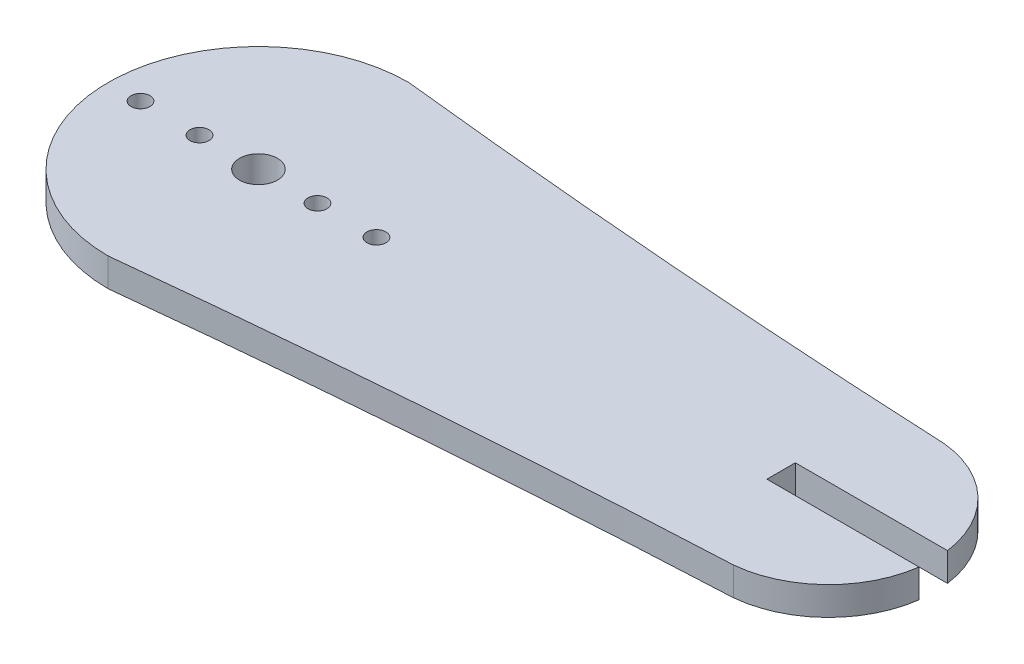
ISO-10303-21;
HEADER;
FILE_DESCRIPTION(('STEP AP214'),'2;1');
FILE_NAME('part.step','',(''),(''),'','','');
FILE_SCHEMA(('AUTOMOTIVE_DESIGN { 1 0 10303 214 1 1 1 1 }'));
ENDSEC;
DATA;
#1=APPLICATION_CONTEXT('core data for automotive mechanical design processes');
#2=APPLICATION_PROTOCOL_DEFINITION('international standard','automotive_design',2000,#1);
#3=PRODUCT_CONTEXT('',#1,'mechanical');
#4=PRODUCT('Part','Part','',(#3));
#5=PRODUCT_RELATED_PRODUCT_CATEGORY('part','',(#4));
#6=PRODUCT_DEFINITION_FORMATION('','',#4);
#7=PRODUCT_DEFINITION_CONTEXT('part definition',#1,'design');
#8=PRODUCT_DEFINITION('design','',#6,#7);
#9=PRODUCT_DEFINITION_SHAPE('','',#8);
#10=(LENGTH_UNIT() NAMED_UNIT(*) SI_UNIT(.MILLI.,.METRE.));
#11=(NAMED_UNIT(*) PLANE_ANGLE_UNIT() SI_UNIT($,.RADIAN.));
#12=(NAMED_UNIT(*) SI_UNIT($,.STERADIAN.) SOLID_ANGLE_UNIT());
#13=UNCERTAINTY_MEASURE_WITH_UNIT(LENGTH_MEASURE(1.E-05),#10,'distance_accuracy_value','');
#14=(GEOMETRIC_REPRESENTATION_CONTEXT(3) GLOBAL_UNCERTAINTY_ASSIGNED_CONTEXT((#13)) GLOBAL_UNIT_ASSIGNED_CONTEXT((#10,
#11,#12)) REPRESENTATION_CONTEXT('',''));
#15=CARTESIAN_POINT('',(0.,0.,0.));
#16=DIRECTION('',(0.,0.,1.));
#17=DIRECTION('',(1.,0.,0.));
#18=AXIS2_PLACEMENT_3D('',#15,#16,#17);
#19=CARTESIAN_POINT('',(0.,3.,13.3404443485137));
#20=DIRECTION('',(0.,0.,-1.));
#21=DIRECTION('',(-1.,0.,0.));
#22=AXIS2_PLACEMENT_3D('',#19,#20,#21);
#23=PLANE('',#22);
#24=DIRECTION('',(1.,0.,0.));
#25=VECTOR('',#24,1.);
#26=CARTESIAN_POINT('',(0.,0.,13.3404443485137));
#27=LINE('',#26,#25);
#28=CARTESIAN_POINT('',(48.1330676185325,0.,13.3404443485137));
#29=VERTEX_POINT('',#28);
#30=CARTESIAN_POINT('',(64.1909738664337,0.,13.3404443485137));
#31=VERTEX_POINT('',#30);
#32=EDGE_CURVE('E144',#29,#31,#27,.T.);
#33=ORIENTED_EDGE('',*,*,#32,.T.);
#34=DIRECTION('',(0.,-1.,0.));
#35=VECTOR('',#34,1.);
#36=CARTESIAN_POINT('',(64.1909738664337,3.,13.3404443485137));
#37=LINE('',#36,#35);
#38=CARTESIAN_POINT('',(64.1909738664337,3.,13.3404443485137));
#39=VERTEX_POINT('',#38);
#40=EDGE_CURVE('E11',#39,#31,#37,.T.);
#41=ORIENTED_EDGE('',*,*,#40,.F.);
#42=DIRECTION('',(1.,0.,0.));
#43=VECTOR('',#42,1.);
#44=CARTESIAN_POINT('',(0.,3.,13.3404443485137));
#45=LINE('',#44,#43);
#46=CARTESIAN_POINT('',(48.1330676185325,3.,13.3404443485137));
#47=VERTEX_POINT('',#46);
#48=EDGE_CURVE('E190',#47,#39,#45,.T.);
#49=ORIENTED_EDGE('',*,*,#48,.F.);
#50=DIRECTION('',(0.,-1.,0.));
#51=VECTOR('',#50,1.);
#52=CARTESIAN_POINT('',(48.1330676185325,3.,13.3404443485137));
#53=LINE('',#52,#51);
#54=EDGE_CURVE('E125',#47,#29,#53,.T.);
#55=ORIENTED_EDGE('',*,*,#54,.T.);
#56=EDGE_LOOP('',(#33,#41,#49,#55));
#57=FACE_BOUND('',#56,.T.);
#58=ADVANCED_FACE('F34',(#57),#23,.F.);
#59=CARTESIAN_POINT('',(53.1355271243014,3.,14.8404443484009));
#60=DIRECTION('',(0.,-1.,0.));
#61=DIRECTION('',(0.,0.,-1.));
#62=AXIS2_PLACEMENT_3D('',#59,#60,#61);
#63=CYLINDRICAL_SURFACE('',#62,11.1567424756438);
#64=CARTESIAN_POINT('',(53.1355271243014,0.,14.8404443484009));
#65=DIRECTION('',(0.,1.,0.));
#66=DIRECTION('',(0.,0.,1.));
#67=AXIS2_PLACEMENT_3D('',#64,#65,#66);
#68=CIRCLE('',#67,11.1567424756438);
#69=CARTESIAN_POINT('',(54.1898263577923,0.,3.73362861237414));
#70=VERTEX_POINT('',#69);
#71=EDGE_CURVE('E147',#31,#70,#68,.T.);
#72=ORIENTED_EDGE('',*,*,#71,.T.);
#73=DIRECTION('',(0.,-1.,0.));
#74=VECTOR('',#73,1.);
#75=CARTESIAN_POINT('',(54.1898263577923,3.,3.73362861237414));
#76=LINE('',#75,#74);
#77=CARTESIAN_POINT('',(54.1898263577923,3.,3.73362861237414));
#78=VERTEX_POINT('',#77);
#79=EDGE_CURVE('E43',#78,#70,#76,.T.);
#80=ORIENTED_EDGE('',*,*,#79,.F.);
#81=CARTESIAN_POINT('',(53.1355271243014,3.,14.8404443484009));
#82=DIRECTION('',(0.,1.,0.));
#83=DIRECTION('',(0.,0.,1.));
#84=AXIS2_PLACEMENT_3D('',#81,#82,#83);
#85=CIRCLE('',#84,11.1567424756438);
#86=EDGE_CURVE('E90',#39,#78,#85,.T.);
#87=ORIENTED_EDGE('',*,*,#86,.F.);
#88=ORIENTED_EDGE('',*,*,#40,.T.);
#89=EDGE_LOOP('',(#72,#80,#87,#88));
#90=FACE_BOUND('',#89,.T.);
#91=ADVANCED_FACE('F176',(#90),#63,.T.);
#92=CARTESIAN_POINT('',(100.965040160951,3.,-995.171812044386));
#93=DIRECTION('',(0.,-1.,0.));
#94=DIRECTION('',(0.,0.,-1.));
#95=AXIS2_PLACEMENT_3D('',#92,#93,#94);
#96=CYLINDRICAL_SURFACE('',#95,1000.);
#97=CARTESIAN_POINT('',(100.965040160951,0.,-995.171812044386));
#98=DIRECTION('',(0.,1.,0.));
#99=DIRECTION('',(0.,0.,1.));
#100=AXIS2_PLACEMENT_3D('',#97,#98,#99);
#101=CIRCLE('',#100,1000.);
#102=CARTESIAN_POINT('',(-7.02241794948157,0.,-1.01955565160642));
#103=VERTEX_POINT('',#102);
#104=EDGE_CURVE('E150',#103,#70,#101,.T.);
#105=ORIENTED_EDGE('',*,*,#104,.F.);
#106=DIRECTION('',(0.,-1.,0.));
#107=VECTOR('',#106,1.);
#108=CARTESIAN_POINT('',(-7.02241794948157,3.,-1.01955565160642));
#109=LINE('',#108,#107);
#110=CARTESIAN_POINT('',(-7.02241794948157,3.,-1.01955565160642));
#111=VERTEX_POINT('',#110);
#112=EDGE_CURVE('E169',#111,#103,#109,.T.);
#113=ORIENTED_EDGE('',*,*,#112,.F.);
#114=CARTESIAN_POINT('',(100.965040160951,3.,-995.171812044386));
#115=DIRECTION('',(0.,1.,0.));
#116=DIRECTION('',(0.,0.,1.));
#117=AXIS2_PLACEMENT_3D('',#114,#115,#116);
#118=CIRCLE('',#117,1000.);
#119=EDGE_CURVE('E175',#111,#78,#118,.T.);
#120=ORIENTED_EDGE('',*,*,#119,.T.);
#121=ORIENTED_EDGE('',*,*,#79,.T.);
#122=EDGE_LOOP('',(#105,#113,#120,#121));
#123=FACE_BOUND('',#122,.T.);
#124=ADVANCED_FACE('F173',(#123),#96,.F.);
#125=CARTESIAN_POINT('',(-7.02241794944201,3.,14.8404443484009));
#126=DIRECTION('',(0.,-1.,0.));
#127=DIRECTION('',(0.,0.,-1.));
#128=AXIS2_PLACEMENT_3D('',#125,#126,#127);
#129=CYLINDRICAL_SURFACE('',#128,15.8600000000073);
#130=CARTESIAN_POINT('',(-7.02241794944201,0.,14.8404443484009));
#131=DIRECTION('',(0.,1.,0.));
#132=DIRECTION('',(0.,0.,1.));
#133=AXIS2_PLACEMENT_3D('',#130,#131,#132);
#134=CIRCLE('',#133,15.8600000000073);
#135=CARTESIAN_POINT('',(-7.02241794947939,0.,30.7004443484083));
#136=VERTEX_POINT('',#135);
#137=EDGE_CURVE('E153',#103,#136,#134,.T.);
#138=ORIENTED_EDGE('',*,*,#137,.T.);
#139=DIRECTION('',(0.,-1.,0.));
#140=VECTOR('',#139,1.);
#141=CARTESIAN_POINT('',(-7.02241794947939,3.,30.7004443484083));
#142=LINE('',#141,#140);
#143=CARTESIAN_POINT('',(-7.02241794947939,3.,30.7004443484083));
#144=VERTEX_POINT('',#143);
#145=EDGE_CURVE('E167',#144,#136,#142,.T.);
#146=ORIENTED_EDGE('',*,*,#145,.F.);
#147=CARTESIAN_POINT('',(-7.02241794944201,3.,14.8404443484009));
#148=DIRECTION('',(0.,1.,0.));
#149=DIRECTION('',(0.,0.,1.));
#150=AXIS2_PLACEMENT_3D('',#147,#148,#149);
#151=CIRCLE('',#150,15.8600000000073);
#152=EDGE_CURVE('E187',#111,#144,#151,.T.);
#153=ORIENTED_EDGE('',*,*,#152,.F.);
#154=ORIENTED_EDGE('',*,*,#112,.T.);
#155=EDGE_LOOP('',(#138,#146,#153,#154));
#156=FACE_BOUND('',#155,.T.);
#157=ADVANCED_FACE('F185',(#156),#129,.T.);
#158=CARTESIAN_POINT('',(100.965040160942,3.,1024.85270074104));
#159=DIRECTION('',(0.,-1.,0.));
#160=DIRECTION('',(0.,0.,-1.));
#161=AXIS2_PLACEMENT_3D('',#158,#159,#160);
#162=CYLINDRICAL_SURFACE('',#161,999.99999999986);
#163=CARTESIAN_POINT('',(100.965040160942,0.,1024.85270074104));
#164=DIRECTION('',(0.,1.,0.));
#165=DIRECTION('',(0.,0.,1.));
#166=AXIS2_PLACEMENT_3D('',#163,#164,#165);
#167=CIRCLE('',#166,999.99999999986);
#168=CARTESIAN_POINT('',(54.1898263578284,0.,25.9472600844262));
#169=VERTEX_POINT('',#168);
#170=EDGE_CURVE('E156',#169,#136,#167,.T.);
#171=ORIENTED_EDGE('',*,*,#170,.F.);
#172=DIRECTION('',(0.,-1.,0.));
#173=VECTOR('',#172,1.);
#174=CARTESIAN_POINT('',(54.1898263578284,3.,25.9472600844262));
#175=LINE('',#174,#173);
#176=CARTESIAN_POINT('',(54.1898263578284,3.,25.9472600844262));
#177=VERTEX_POINT('',#176);
#178=EDGE_CURVE('E121',#177,#169,#175,.T.);
#179=ORIENTED_EDGE('',*,*,#178,.F.);
#180=CARTESIAN_POINT('',(100.965040160942,3.,1024.85270074104));
#181=DIRECTION('',(0.,1.,0.));
#182=DIRECTION('',(0.,0.,1.));
#183=AXIS2_PLACEMENT_3D('',#180,#181,#182);
#184=CIRCLE('',#183,999.99999999986);
#185=EDGE_CURVE('E110',#177,#144,#184,.T.);
#186=ORIENTED_EDGE('',*,*,#185,.T.);
#187=ORIENTED_EDGE('',*,*,#145,.T.);
#188=EDGE_LOOP('',(#171,#179,#186,#187));
#189=FACE_BOUND('',#188,.T.);
#190=ADVANCED_FACE('F194',(#189),#162,.F.);
#191=CARTESIAN_POINT('',(53.1355271243014,3.,14.8404443484009));
#192=DIRECTION('',(0.,-1.,0.));
#193=DIRECTION('',(0.,0.,-1.));
#194=AXIS2_PLACEMENT_3D('',#191,#192,#193);
#195=CYLINDRICAL_SURFACE('',#194,11.1567424756438);
#196=CARTESIAN_POINT('',(53.1355271243014,0.,14.8404443484009));
#197=DIRECTION('',(0.,1.,0.));
#198=DIRECTION('',(0.,0.,1.));
#199=AXIS2_PLACEMENT_3D('',#196,#197,#198);
#200=CIRCLE('',#199,11.1567424756438);
#201=CARTESIAN_POINT('',(64.1909738664337,0.,16.3404443482881));
#202=VERTEX_POINT('',#201);
#203=EDGE_CURVE('E117',#169,#202,#200,.T.);
#204=ORIENTED_EDGE('',*,*,#203,.T.);
#205=DIRECTION('',(0.,-1.,0.));
#206=VECTOR('',#205,1.);
#207=CARTESIAN_POINT('',(64.1909738664337,3.,16.3404443482881));
#208=LINE('',#207,#206);
#209=CARTESIAN_POINT('',(64.1909738664337,3.,16.3404443482881));
#210=VERTEX_POINT('',#209);
#211=EDGE_CURVE('E114',#210,#202,#208,.T.);
#212=ORIENTED_EDGE('',*,*,#211,.F.);
#213=CARTESIAN_POINT('',(53.1355271243014,3.,14.8404443484009));
#214=DIRECTION('',(0.,1.,0.));
#215=DIRECTION('',(0.,0.,1.));
#216=AXIS2_PLACEMENT_3D('',#213,#214,#215);
#217=CIRCLE('',#216,11.1567424756438);
#218=EDGE_CURVE('E104',#177,#210,#217,.T.);
#219=ORIENTED_EDGE('',*,*,#218,.F.);
#220=ORIENTED_EDGE('',*,*,#178,.T.);
#221=EDGE_LOOP('',(#204,#212,#219,#220));
#222=FACE_BOUND('',#221,.T.);
#223=ADVANCED_FACE('F115',(#222),#195,.T.);
#224=CARTESIAN_POINT('',(0.,3.,16.3404443482881));
#225=DIRECTION('',(0.,0.,-1.));
#226=DIRECTION('',(-1.,0.,0.));
#227=AXIS2_PLACEMENT_3D('',#224,#225,#226);
#228=PLANE('',#227);
#229=DIRECTION('',(1.,0.,0.));
#230=VECTOR('',#229,1.);
#231=CARTESIAN_POINT('',(0.,0.,16.3404443482881));
#232=LINE('',#231,#230);
#233=CARTESIAN_POINT('',(48.1330676185325,0.,16.3404443482881));
#234=VERTEX_POINT('',#233);
#235=EDGE_CURVE('E160',#234,#202,#232,.T.);
#236=ORIENTED_EDGE('',*,*,#235,.F.);
#237=DIRECTION('',(0.,-1.,0.));
#238=VECTOR('',#237,1.);
#239=CARTESIAN_POINT('',(48.1330676185325,3.,16.3404443482881));
#240=LINE('',#239,#238);
#241=CARTESIAN_POINT('',(48.1330676185325,3.,16.3404443482881));
#242=VERTEX_POINT('',#241);
#243=EDGE_CURVE('E79',#242,#234,#240,.T.);
#244=ORIENTED_EDGE('',*,*,#243,.F.);
#245=DIRECTION('',(1.,0.,0.));
#246=VECTOR('',#245,1.);
#247=CARTESIAN_POINT('',(0.,3.,16.3404443482881));
#248=LINE('',#247,#246);
#249=EDGE_CURVE('E108',#242,#210,#248,.T.);
#250=ORIENTED_EDGE('',*,*,#249,.T.);
#251=ORIENTED_EDGE('',*,*,#211,.T.);
#252=EDGE_LOOP('',(#236,#244,#250,#251));
#253=FACE_BOUND('',#252,.T.);
#254=ADVANCED_FACE('F123',(#253),#228,.T.);
#255=CARTESIAN_POINT('',(-19.472417949442,3.,14.8404443484009));
#256=DIRECTION('',(0.,-1.,0.));
#257=DIRECTION('',(0.,0.,-1.));
#258=AXIS2_PLACEMENT_3D('',#255,#256,#257);
#259=CYLINDRICAL_SURFACE('',#258,1.00000000004549);
#260=CARTESIAN_POINT('',(-19.472417949442,3.,14.8404443484009));
#261=DIRECTION('',(0.,1.,0.));
#262=DIRECTION('',(0.,0.,1.));
#263=AXIS2_PLACEMENT_3D('',#260,#261,#262);
#264=CIRCLE('',#263,1.00000000004549);
#265=CARTESIAN_POINT('',(-19.472417949442,3.,15.8404443484464));
#266=VERTEX_POINT('',#265);
#267=EDGE_CURVE('E355',#266,#266,#264,.F.);
#268=ORIENTED_EDGE('',*,*,#267,.F.);
#269=EDGE_LOOP('',(#268));
#270=FACE_BOUND('',#269,.T.);
#271=CARTESIAN_POINT('',(-19.472417949442,0.,14.8404443484009));
#272=DIRECTION('',(0.,1.,0.));
#273=DIRECTION('',(0.,0.,1.));
#274=AXIS2_PLACEMENT_3D('',#271,#272,#273);
#275=CIRCLE('',#274,1.00000000004549);
#276=CARTESIAN_POINT('',(-19.472417949442,0.,15.8404443484464));
#277=VERTEX_POINT('',#276);
#278=EDGE_CURVE('E141',#277,#277,#275,.F.);
#279=ORIENTED_EDGE('',*,*,#278,.T.);
#280=EDGE_LOOP('',(#279));
#281=FACE_BOUND('',#280,.T.);
#282=ADVANCED_FACE('F218',(#270,#281),#259,.F.);
#283=CARTESIAN_POINT('',(5.42758205055799,3.,14.8404443484009));
#284=DIRECTION('',(0.,-1.,0.));
#285=DIRECTION('',(0.,0.,-1.));
#286=AXIS2_PLACEMENT_3D('',#283,#284,#285);
#287=CYLINDRICAL_SURFACE('',#286,1.00000000004549);
#288=CARTESIAN_POINT('',(5.42758205055799,3.,14.8404443484009));
#289=DIRECTION('',(0.,1.,0.));
#290=DIRECTION('',(0.,0.,1.));
#291=AXIS2_PLACEMENT_3D('',#288,#289,#290);
#292=CIRCLE('',#291,1.00000000004549);
#293=CARTESIAN_POINT('',(5.42758205055799,3.,15.8404443484464));
#294=VERTEX_POINT('',#293);
#295=EDGE_CURVE('E348',#294,#294,#292,.T.);
#296=ORIENTED_EDGE('',*,*,#295,.T.);
#297=EDGE_LOOP('',(#296));
#298=FACE_BOUND('',#297,.T.);
#299=CARTESIAN_POINT('',(5.42758205055799,0.,14.8404443484009));
#300=DIRECTION('',(0.,1.,0.));
#301=DIRECTION('',(0.,0.,1.));
#302=AXIS2_PLACEMENT_3D('',#299,#300,#301);
#303=CIRCLE('',#302,1.00000000004549);
#304=CARTESIAN_POINT('',(5.42758205055799,0.,15.8404443484464));
#305=VERTEX_POINT('',#304);
#306=EDGE_CURVE('E138',#305,#305,#303,.T.);
#307=ORIENTED_EDGE('',*,*,#306,.F.);
#308=EDGE_LOOP('',(#307));
#309=FACE_BOUND('',#308,.T.);
#310=ADVANCED_FACE('F221',(#298,#309),#287,.F.);
#311=CARTESIAN_POINT('',(-0.797417949442007,3.,14.8404443484009));
#312=DIRECTION('',(0.,-1.,0.));
#313=DIRECTION('',(0.,0.,-1.));
#314=AXIS2_PLACEMENT_3D('',#311,#312,#313);
#315=CYLINDRICAL_SURFACE('',#314,1.00000000004549);
#316=CARTESIAN_POINT('',(-0.797417949442007,3.,14.8404443484009));
#317=DIRECTION('',(0.,1.,0.));
#318=DIRECTION('',(0.,0.,1.));
#319=AXIS2_PLACEMENT_3D('',#316,#317,#318);
#320=CIRCLE('',#319,1.00000000004549);
#321=CARTESIAN_POINT('',(-0.797417949442007,3.,15.8404443484464));
#322=VERTEX_POINT('',#321);
#323=EDGE_CURVE('E345',#322,#322,#320,.T.);
#324=ORIENTED_EDGE('',*,*,#323,.T.);
#325=EDGE_LOOP('',(#324));
#326=FACE_BOUND('',#325,.T.);
#327=CARTESIAN_POINT('',(-0.797417949442007,0.,14.8404443484009));
#328=DIRECTION('',(0.,1.,0.));
#329=DIRECTION('',(0.,0.,1.));
#330=AXIS2_PLACEMENT_3D('',#327,#328,#329);
#331=CIRCLE('',#330,1.00000000004549);
#332=CARTESIAN_POINT('',(-0.797417949442007,0.,15.8404443484464));
#333=VERTEX_POINT('',#332);
#334=EDGE_CURVE('E135',#333,#333,#331,.T.);
#335=ORIENTED_EDGE('',*,*,#334,.F.);
#336=EDGE_LOOP('',(#335));
#337=FACE_BOUND('',#336,.T.);
#338=ADVANCED_FACE('F225',(#326,#337),#315,.F.);
#339=CARTESIAN_POINT('',(-7.02241794944201,3.,14.8404443484009));
#340=DIRECTION('',(0.,-1.,0.));
#341=DIRECTION('',(0.,0.,-1.));
#342=AXIS2_PLACEMENT_3D('',#339,#340,#341);
#343=CYLINDRICAL_SURFACE('',#342,2.00000000004549);
#344=CARTESIAN_POINT('',(-7.02241794944201,3.,14.8404443484009));
#345=DIRECTION('',(0.,1.,0.));
#346=DIRECTION('',(0.,0.,1.));
#347=AXIS2_PLACEMENT_3D('',#344,#345,#346);
#348=CIRCLE('',#347,2.00000000004549);
#349=CARTESIAN_POINT('',(-7.02241794944201,3.,16.8404443484464));
#350=VERTEX_POINT('',#349);
#351=EDGE_CURVE('E236',#350,#350,#348,.T.);
#352=ORIENTED_EDGE('',*,*,#351,.T.);
#353=EDGE_LOOP('',(#352));
#354=FACE_BOUND('',#353,.T.);
#355=CARTESIAN_POINT('',(-7.02241794944201,0.,14.8404443484009));
#356=DIRECTION('',(0.,1.,0.));
#357=DIRECTION('',(0.,0.,1.));
#358=AXIS2_PLACEMENT_3D('',#355,#356,#357);
#359=CIRCLE('',#358,2.00000000004549);
#360=CARTESIAN_POINT('',(-7.02241794944201,0.,16.8404443484464));
#361=VERTEX_POINT('',#360);
#362=EDGE_CURVE('E132',#361,#361,#359,.T.);
#363=ORIENTED_EDGE('',*,*,#362,.F.);
#364=EDGE_LOOP('',(#363));
#365=FACE_BOUND('',#364,.T.);
#366=ADVANCED_FACE('F206',(#354,#365),#343,.F.);
#367=CARTESIAN_POINT('',(-13.247417949442,3.,14.8404443484009));
#368=DIRECTION('',(0.,-1.,0.));
#369=DIRECTION('',(0.,0.,-1.));
#370=AXIS2_PLACEMENT_3D('',#367,#368,#369);
#371=CYLINDRICAL_SURFACE('',#370,1.00000000004549);
#372=CARTESIAN_POINT('',(-13.247417949442,3.,14.8404443484009));
#373=DIRECTION('',(0.,1.,0.));
#374=DIRECTION('',(0.,0.,1.));
#375=AXIS2_PLACEMENT_3D('',#372,#373,#374);
#376=CIRCLE('',#375,1.00000000004549);
#377=CARTESIAN_POINT('',(-13.247417949442,3.,15.8404443484464));
#378=VERTEX_POINT('',#377);
#379=EDGE_CURVE('E163',#378,#378,#376,.F.);
#380=ORIENTED_EDGE('',*,*,#379,.F.);
#381=EDGE_LOOP('',(#380));
#382=FACE_BOUND('',#381,.T.);
#383=CARTESIAN_POINT('',(-13.247417949442,0.,14.8404443484009));
#384=DIRECTION('',(0.,1.,0.));
#385=DIRECTION('',(0.,0.,1.));
#386=AXIS2_PLACEMENT_3D('',#383,#384,#385);
#387=CIRCLE('',#386,1.00000000004549);
#388=CARTESIAN_POINT('',(-13.247417949442,0.,15.8404443484464));
#389=VERTEX_POINT('',#388);
#390=EDGE_CURVE('E129',#389,#389,#387,.F.);
#391=ORIENTED_EDGE('',*,*,#390,.T.);
#392=EDGE_LOOP('',(#391));
#393=FACE_BOUND('',#392,.T.);
#394=ADVANCED_FACE('F36',(#382,#393),#371,.F.);
#395=CARTESIAN_POINT('',(48.1330676185325,3.,0.));
#396=DIRECTION('',(-1.,0.,0.));
#397=DIRECTION('',(0.,0.,1.));
#398=AXIS2_PLACEMENT_3D('',#395,#396,#397);
#399=PLANE('',#398);
#400=DIRECTION('',(0.,0.,-1.));
#401=VECTOR('',#400,1.);
#402=CARTESIAN_POINT('',(48.1330676185325,0.,0.));
#403=LINE('',#402,#401);
#404=EDGE_CURVE('E82',#234,#29,#403,.T.);
#405=ORIENTED_EDGE('',*,*,#404,.T.);
#406=ORIENTED_EDGE('',*,*,#54,.F.);
#407=DIRECTION('',(0.,0.,-1.));
#408=VECTOR('',#407,1.);
#409=CARTESIAN_POINT('',(48.1330676185325,3.,0.));
#410=LINE('',#409,#408);
#411=EDGE_CURVE('E51',#242,#47,#410,.T.);
#412=ORIENTED_EDGE('',*,*,#411,.F.);
#413=ORIENTED_EDGE('',*,*,#243,.T.);
#414=EDGE_LOOP('',(#405,#406,#412,#413));
#415=FACE_BOUND('',#414,.T.);
#416=ADVANCED_FACE('F197',(#415),#399,.F.);
#417=CARTESIAN_POINT('',(0.,3.,0.));
#418=DIRECTION('',(0.,1.,0.));
#419=DIRECTION('',(0.,0.,1.));
#420=AXIS2_PLACEMENT_3D('',#417,#418,#419);
#421=PLANE('',#420);
#422=ORIENTED_EDGE('',*,*,#379,.T.);
#423=EDGE_LOOP('',(#422));
#424=FACE_BOUND('',#423,.T.);
#425=ORIENTED_EDGE('',*,*,#351,.F.);
#426=EDGE_LOOP('',(#425));
#427=FACE_BOUND('',#426,.T.);
#428=ORIENTED_EDGE('',*,*,#323,.F.);
#429=EDGE_LOOP('',(#428));
#430=FACE_BOUND('',#429,.T.);
#431=ORIENTED_EDGE('',*,*,#295,.F.);
#432=EDGE_LOOP('',(#431));
#433=FACE_BOUND('',#432,.T.);
#434=ORIENTED_EDGE('',*,*,#267,.T.);
#435=EDGE_LOOP('',(#434));
#436=FACE_BOUND('',#435,.T.);
#437=ORIENTED_EDGE('',*,*,#48,.T.);
#438=ORIENTED_EDGE('',*,*,#86,.T.);
#439=ORIENTED_EDGE('',*,*,#119,.F.);
#440=ORIENTED_EDGE('',*,*,#152,.T.);
#441=ORIENTED_EDGE('',*,*,#185,.F.);
#442=ORIENTED_EDGE('',*,*,#218,.T.);
#443=ORIENTED_EDGE('',*,*,#249,.F.);
#444=ORIENTED_EDGE('',*,*,#411,.T.);
#445=EDGE_LOOP('',(#437,#438,#439,#440,#441,#442,#443,#444));
#446=FACE_BOUND('',#445,.T.);
#447=ADVANCED_FACE('F106',(#424,#427,#430,#433,#436,#446),#421,.T.);
#448=CARTESIAN_POINT('',(0.,0.,0.));
#449=DIRECTION('',(0.,1.,0.));
#450=DIRECTION('',(0.,0.,1.));
#451=AXIS2_PLACEMENT_3D('',#448,#449,#450);
#452=PLANE('',#451);
#453=ORIENTED_EDGE('',*,*,#390,.F.);
#454=EDGE_LOOP('',(#453));
#455=FACE_BOUND('',#454,.T.);
#456=ORIENTED_EDGE('',*,*,#362,.T.);
#457=EDGE_LOOP('',(#456));
#458=FACE_BOUND('',#457,.T.);
#459=ORIENTED_EDGE('',*,*,#334,.T.);
#460=EDGE_LOOP('',(#459));
#461=FACE_BOUND('',#460,.T.);
#462=ORIENTED_EDGE('',*,*,#306,.T.);
#463=EDGE_LOOP('',(#462));
#464=FACE_BOUND('',#463,.T.);
#465=ORIENTED_EDGE('',*,*,#278,.F.);
#466=EDGE_LOOP('',(#465));
#467=FACE_BOUND('',#466,.T.);
#468=ORIENTED_EDGE('',*,*,#32,.F.);
#469=ORIENTED_EDGE('',*,*,#404,.F.);
#470=ORIENTED_EDGE('',*,*,#235,.T.);
#471=ORIENTED_EDGE('',*,*,#203,.F.);
#472=ORIENTED_EDGE('',*,*,#170,.T.);
#473=ORIENTED_EDGE('',*,*,#137,.F.);
#474=ORIENTED_EDGE('',*,*,#104,.T.);
#475=ORIENTED_EDGE('',*,*,#71,.F.);
#476=EDGE_LOOP('',(#468,#469,#470,#471,#472,#473,#474,#475));
#477=FACE_BOUND('',#476,.T.);
#478=ADVANCED_FACE('F181',(#455,#458,#461,#464,#467,#477),#452,.F.);
#479=CLOSED_SHELL('',(#58,#91,#124,#157,#190,#223,#254,#282,#310,#338,#366,#394,#416,#447,#478));
#480=MANIFOLD_SOLID_BREP('B2',#479);
#481=ADVANCED_BREP_SHAPE_REPRESENTATION('',(#18,#480),#14);
#482=SHAPE_DEFINITION_REPRESENTATION(#9,#481);
ENDSEC;
END-ISO-10303-21;
